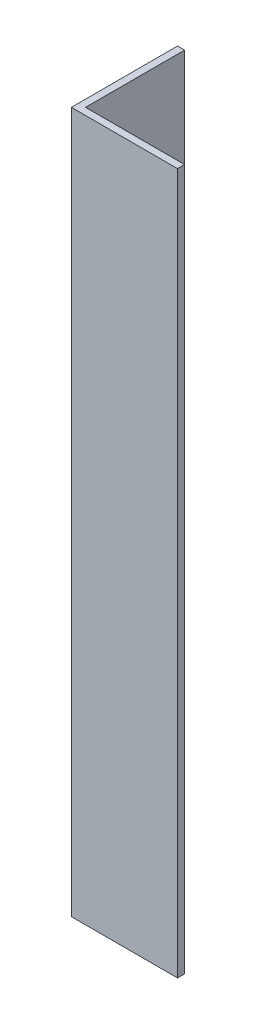
ISO-10303-21;
HEADER;
FILE_DESCRIPTION(('STEP AP214'),'2;1');
FILE_NAME('part.step','',(''),(''),'','','');
FILE_SCHEMA(('AUTOMOTIVE_DESIGN { 1 0 10303 214 1 1 1 1 }'));
ENDSEC;
DATA;
#1=APPLICATION_CONTEXT('core data for automotive mechanical design processes');
#2=APPLICATION_PROTOCOL_DEFINITION('international standard','automotive_design',2000,#1);
#3=PRODUCT_CONTEXT('',#1,'mechanical');
#4=PRODUCT('Part','Part','',(#3));
#5=PRODUCT_RELATED_PRODUCT_CATEGORY('part','',(#4));
#6=PRODUCT_DEFINITION_FORMATION('','',#4);
#7=PRODUCT_DEFINITION_CONTEXT('part definition',#1,'design');
#8=PRODUCT_DEFINITION('design','',#6,#7);
#9=PRODUCT_DEFINITION_SHAPE('','',#8);
#10=(LENGTH_UNIT() NAMED_UNIT(*) SI_UNIT(.MILLI.,.METRE.));
#11=(NAMED_UNIT(*) PLANE_ANGLE_UNIT() SI_UNIT($,.RADIAN.));
#12=(NAMED_UNIT(*) SI_UNIT($,.STERADIAN.) SOLID_ANGLE_UNIT());
#13=UNCERTAINTY_MEASURE_WITH_UNIT(LENGTH_MEASURE(1.E-05),#10,'distance_accuracy_value','');
#14=(GEOMETRIC_REPRESENTATION_CONTEXT(3) GLOBAL_UNCERTAINTY_ASSIGNED_CONTEXT((#13)) GLOBAL_UNIT_ASSIGNED_CONTEXT((#10,
#11,#12)) REPRESENTATION_CONTEXT('',''));
#15=CARTESIAN_POINT('',(0.,0.,0.));
#16=DIRECTION('',(0.,0.,1.));
#17=DIRECTION('',(1.,0.,0.));
#18=AXIS2_PLACEMENT_3D('',#15,#16,#17);
#19=CARTESIAN_POINT('',(15.,99.,0.));
#20=DIRECTION('',(0.,0.,-1.));
#21=DIRECTION('',(-1.,0.,0.));
#22=AXIS2_PLACEMENT_3D('',#19,#20,#21);
#23=PLANE('',#22);
#24=DIRECTION('',(1.,0.,0.));
#25=VECTOR('',#24,1.);
#26=CARTESIAN_POINT('',(15.,0.,0.));
#27=LINE('',#26,#25);
#28=CARTESIAN_POINT('',(0.,0.,0.));
#29=VERTEX_POINT('',#28);
#30=CARTESIAN_POINT('',(15.,0.,0.));
#31=VERTEX_POINT('',#30);
#32=EDGE_CURVE('E117',#29,#31,#27,.T.);
#33=ORIENTED_EDGE('',*,*,#32,.T.);
#34=DIRECTION('',(0.,-1.,0.));
#35=VECTOR('',#34,1.);
#36=CARTESIAN_POINT('',(15.,99.,0.));
#37=LINE('',#36,#35);
#38=CARTESIAN_POINT('',(15.,99.,0.));
#39=VERTEX_POINT('',#38);
#40=EDGE_CURVE('E11',#39,#31,#37,.T.);
#41=ORIENTED_EDGE('',*,*,#40,.F.);
#42=DIRECTION('',(1.,0.,0.));
#43=VECTOR('',#42,1.);
#44=CARTESIAN_POINT('',(15.,99.,0.));
#45=LINE('',#44,#43);
#46=CARTESIAN_POINT('',(0.,99.,0.));
#47=VERTEX_POINT('',#46);
#48=EDGE_CURVE('E127',#47,#39,#45,.T.);
#49=ORIENTED_EDGE('',*,*,#48,.F.);
#50=DIRECTION('',(0.,-1.,0.));
#51=VECTOR('',#50,1.);
#52=CARTESIAN_POINT('',(0.,99.,0.));
#53=LINE('',#52,#51);
#54=EDGE_CURVE('E113',#47,#29,#53,.T.);
#55=ORIENTED_EDGE('',*,*,#54,.T.);
#56=EDGE_LOOP('',(#33,#41,#49,#55));
#57=FACE_BOUND('',#56,.T.);
#58=ADVANCED_FACE('F33',(#57),#23,.F.);
#59=CARTESIAN_POINT('',(15.,99.,-0.999999999999998));
#60=DIRECTION('',(-1.,0.,0.));
#61=DIRECTION('',(0.,0.,1.));
#62=AXIS2_PLACEMENT_3D('',#59,#60,#61);
#63=PLANE('',#62);
#64=DIRECTION('',(0.,0.,-1.));
#65=VECTOR('',#64,1.);
#66=CARTESIAN_POINT('',(15.,0.,-0.999999999999998));
#67=LINE('',#66,#65);
#68=CARTESIAN_POINT('',(15.,0.,-0.999999999999998));
#69=VERTEX_POINT('',#68);
#70=EDGE_CURVE('E120',#31,#69,#67,.T.);
#71=ORIENTED_EDGE('',*,*,#70,.T.);
#72=DIRECTION('',(0.,-1.,0.));
#73=VECTOR('',#72,1.);
#74=CARTESIAN_POINT('',(15.,99.,-0.999999999999998));
#75=LINE('',#74,#73);
#76=CARTESIAN_POINT('',(15.,99.,-0.999999999999998));
#77=VERTEX_POINT('',#76);
#78=EDGE_CURVE('E41',#77,#69,#75,.T.);
#79=ORIENTED_EDGE('',*,*,#78,.F.);
#80=DIRECTION('',(0.,0.,-1.));
#81=VECTOR('',#80,1.);
#82=CARTESIAN_POINT('',(15.,99.,-0.999999999999998));
#83=LINE('',#82,#81);
#84=EDGE_CURVE('E86',#39,#77,#83,.T.);
#85=ORIENTED_EDGE('',*,*,#84,.F.);
#86=ORIENTED_EDGE('',*,*,#40,.T.);
#87=EDGE_LOOP('',(#71,#79,#85,#86));
#88=FACE_BOUND('',#87,.T.);
#89=ADVANCED_FACE('F151',(#88),#63,.F.);
#90=CARTESIAN_POINT('',(1.,99.,-0.999999999999997));
#91=DIRECTION('',(0.,0.,1.));
#92=DIRECTION('',(1.,0.,0.));
#93=AXIS2_PLACEMENT_3D('',#90,#91,#92);
#94=PLANE('',#93);
#95=DIRECTION('',(-1.,0.,0.));
#96=VECTOR('',#95,1.);
#97=CARTESIAN_POINT('',(1.,0.,-0.999999999999997));
#98=LINE('',#97,#96);
#99=CARTESIAN_POINT('',(1.,0.,-0.999999999999997));
#100=VERTEX_POINT('',#99);
#101=EDGE_CURVE('E122',#69,#100,#98,.T.);
#102=ORIENTED_EDGE('',*,*,#101,.T.);
#103=DIRECTION('',(0.,-1.,0.));
#104=VECTOR('',#103,1.);
#105=CARTESIAN_POINT('',(1.,99.,-0.999999999999997));
#106=LINE('',#105,#104);
#107=CARTESIAN_POINT('',(1.,99.,-0.999999999999997));
#108=VERTEX_POINT('',#107);
#109=EDGE_CURVE('E108',#108,#100,#106,.T.);
#110=ORIENTED_EDGE('',*,*,#109,.F.);
#111=DIRECTION('',(-1.,0.,0.));
#112=VECTOR('',#111,1.);
#113=CARTESIAN_POINT('',(1.,99.,-0.999999999999997));
#114=LINE('',#113,#112);
#115=EDGE_CURVE('E99',#77,#108,#114,.T.);
#116=ORIENTED_EDGE('',*,*,#115,.F.);
#117=ORIENTED_EDGE('',*,*,#78,.T.);
#118=EDGE_LOOP('',(#102,#110,#116,#117));
#119=FACE_BOUND('',#118,.T.);
#120=ADVANCED_FACE('F133',(#119),#94,.F.);
#121=CARTESIAN_POINT('',(0.999999999999998,99.,-15.));
#122=DIRECTION('',(-1.,0.,0.));
#123=DIRECTION('',(0.,0.,1.));
#124=AXIS2_PLACEMENT_3D('',#121,#122,#123);
#125=PLANE('',#124);
#126=DIRECTION('',(0.,0.,-1.));
#127=VECTOR('',#126,1.);
#128=CARTESIAN_POINT('',(0.999999999999998,0.,-15.));
#129=LINE('',#128,#127);
#130=CARTESIAN_POINT('',(0.999999999999998,0.,-15.));
#131=VERTEX_POINT('',#130);
#132=EDGE_CURVE('E107',#100,#131,#129,.T.);
#133=ORIENTED_EDGE('',*,*,#132,.T.);
#134=DIRECTION('',(0.,-1.,0.));
#135=VECTOR('',#134,1.);
#136=CARTESIAN_POINT('',(0.999999999999998,99.,-15.));
#137=LINE('',#136,#135);
#138=CARTESIAN_POINT('',(0.999999999999998,99.,-15.));
#139=VERTEX_POINT('',#138);
#140=EDGE_CURVE('E104',#139,#131,#137,.T.);
#141=ORIENTED_EDGE('',*,*,#140,.F.);
#142=DIRECTION('',(0.,0.,-1.));
#143=VECTOR('',#142,1.);
#144=CARTESIAN_POINT('',(0.999999999999998,99.,-15.));
#145=LINE('',#144,#143);
#146=EDGE_CURVE('E93',#108,#139,#145,.T.);
#147=ORIENTED_EDGE('',*,*,#146,.F.);
#148=ORIENTED_EDGE('',*,*,#109,.T.);
#149=EDGE_LOOP('',(#133,#141,#147,#148));
#150=FACE_BOUND('',#149,.T.);
#151=ADVANCED_FACE('F105',(#150),#125,.F.);
#152=CARTESIAN_POINT('',(0.,99.,-15.));
#153=DIRECTION('',(0.,0.,1.));
#154=DIRECTION('',(1.,0.,0.));
#155=AXIS2_PLACEMENT_3D('',#152,#153,#154);
#156=PLANE('',#155);
#157=DIRECTION('',(-1.,0.,0.));
#158=VECTOR('',#157,1.);
#159=CARTESIAN_POINT('',(0.,0.,-15.));
#160=LINE('',#159,#158);
#161=CARTESIAN_POINT('',(0.,0.,-15.));
#162=VERTEX_POINT('',#161);
#163=EDGE_CURVE('E72',#131,#162,#160,.T.);
#164=ORIENTED_EDGE('',*,*,#163,.T.);
#165=DIRECTION('',(0.,-1.,0.));
#166=VECTOR('',#165,1.);
#167=CARTESIAN_POINT('',(0.,99.,-15.));
#168=LINE('',#167,#166);
#169=CARTESIAN_POINT('',(0.,99.,-15.));
#170=VERTEX_POINT('',#169);
#171=EDGE_CURVE('E109',#170,#162,#168,.T.);
#172=ORIENTED_EDGE('',*,*,#171,.F.);
#173=DIRECTION('',(-1.,0.,0.));
#174=VECTOR('',#173,1.);
#175=CARTESIAN_POINT('',(0.,99.,-15.));
#176=LINE('',#175,#174);
#177=EDGE_CURVE('E97',#139,#170,#176,.T.);
#178=ORIENTED_EDGE('',*,*,#177,.F.);
#179=ORIENTED_EDGE('',*,*,#140,.T.);
#180=EDGE_LOOP('',(#164,#172,#178,#179));
#181=FACE_BOUND('',#180,.T.);
#182=ADVANCED_FACE('F111',(#181),#156,.F.);
#183=CARTESIAN_POINT('',(0.,99.,0.));
#184=DIRECTION('',(1.,0.,0.));
#185=DIRECTION('',(0.,0.,-1.));
#186=AXIS2_PLACEMENT_3D('',#183,#184,#185);
#187=PLANE('',#186);
#188=DIRECTION('',(0.,0.,1.));
#189=VECTOR('',#188,1.);
#190=CARTESIAN_POINT('',(0.,0.,0.));
#191=LINE('',#190,#189);
#192=EDGE_CURVE('E78',#162,#29,#191,.T.);
#193=ORIENTED_EDGE('',*,*,#192,.T.);
#194=ORIENTED_EDGE('',*,*,#54,.F.);
#195=DIRECTION('',(0.,0.,1.));
#196=VECTOR('',#195,1.);
#197=CARTESIAN_POINT('',(0.,99.,0.));
#198=LINE('',#197,#196);
#199=EDGE_CURVE('E49',#170,#47,#198,.T.);
#200=ORIENTED_EDGE('',*,*,#199,.F.);
#201=ORIENTED_EDGE('',*,*,#171,.T.);
#202=EDGE_LOOP('',(#193,#194,#200,#201));
#203=FACE_BOUND('',#202,.T.);
#204=ADVANCED_FACE('F140',(#203),#187,.F.);
#205=CARTESIAN_POINT('',(0.,99.,0.));
#206=DIRECTION('',(0.,-1.,0.));
#207=DIRECTION('',(0.,0.,-1.));
#208=AXIS2_PLACEMENT_3D('',#205,#206,#207);
#209=PLANE('',#208);
#210=ORIENTED_EDGE('',*,*,#48,.T.);
#211=ORIENTED_EDGE('',*,*,#84,.T.);
#212=ORIENTED_EDGE('',*,*,#115,.T.);
#213=ORIENTED_EDGE('',*,*,#146,.T.);
#214=ORIENTED_EDGE('',*,*,#177,.T.);
#215=ORIENTED_EDGE('',*,*,#199,.T.);
#216=EDGE_LOOP('',(#210,#211,#212,#213,#214,#215));
#217=FACE_BOUND('',#216,.T.);
#218=ADVANCED_FACE('F95',(#217),#209,.F.);
#219=CARTESIAN_POINT('',(0.,0.,0.));
#220=DIRECTION('',(0.,-1.,0.));
#221=DIRECTION('',(0.,0.,-1.));
#222=AXIS2_PLACEMENT_3D('',#219,#220,#221);
#223=PLANE('',#222);
#224=ORIENTED_EDGE('',*,*,#32,.F.);
#225=ORIENTED_EDGE('',*,*,#192,.F.);
#226=ORIENTED_EDGE('',*,*,#163,.F.);
#227=ORIENTED_EDGE('',*,*,#132,.F.);
#228=ORIENTED_EDGE('',*,*,#101,.F.);
#229=ORIENTED_EDGE('',*,*,#70,.F.);
#230=EDGE_LOOP('',(#224,#225,#226,#227,#228,#229));
#231=FACE_BOUND('',#230,.T.);
#232=ADVANCED_FACE('F136',(#231),#223,.T.);
#233=CLOSED_SHELL('',(#58,#89,#120,#151,#182,#204,#218,#232));
#234=MANIFOLD_SOLID_BREP('B2',#233);
#235=ADVANCED_BREP_SHAPE_REPRESENTATION('',(#18,#234),#14);
#236=SHAPE_DEFINITION_REPRESENTATION(#9,#235);
ENDSEC;
END-ISO-10303-21;
